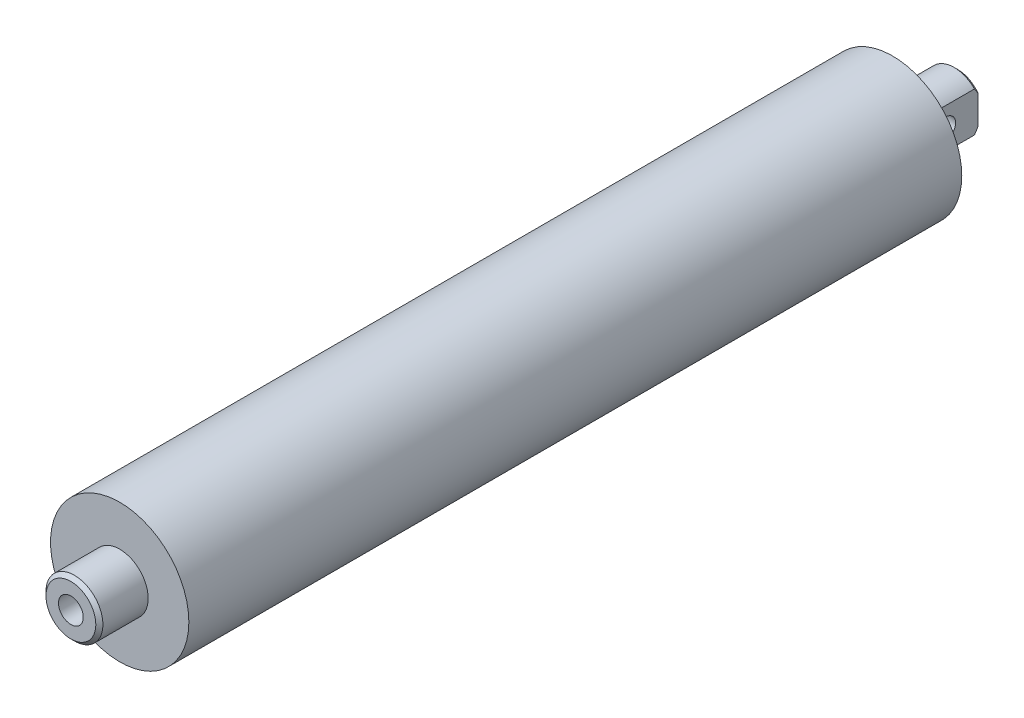
ISO-10303-21;
HEADER;
FILE_DESCRIPTION(('STEP AP214'),'2;1');
FILE_NAME('part.step','',(''),(''),'','','');
FILE_SCHEMA(('AUTOMOTIVE_DESIGN { 1 0 10303 214 1 1 1 1 }'));
ENDSEC;
DATA;
#1=APPLICATION_CONTEXT('core data for automotive mechanical design processes');
#2=APPLICATION_PROTOCOL_DEFINITION('international standard','automotive_design',2000,#1);
#3=PRODUCT_CONTEXT('',#1,'mechanical');
#4=PRODUCT('Part','Part','',(#3));
#5=PRODUCT_RELATED_PRODUCT_CATEGORY('part','',(#4));
#6=PRODUCT_DEFINITION_FORMATION('','',#4);
#7=PRODUCT_DEFINITION_CONTEXT('part definition',#1,'design');
#8=PRODUCT_DEFINITION('design','',#6,#7);
#9=PRODUCT_DEFINITION_SHAPE('','',#8);
#10=(LENGTH_UNIT() NAMED_UNIT(*) SI_UNIT(.MILLI.,.METRE.));
#11=(NAMED_UNIT(*) PLANE_ANGLE_UNIT() SI_UNIT($,.RADIAN.));
#12=(NAMED_UNIT(*) SI_UNIT($,.STERADIAN.) SOLID_ANGLE_UNIT());
#13=UNCERTAINTY_MEASURE_WITH_UNIT(LENGTH_MEASURE(1.E-05),#10,'distance_accuracy_value','');
#14=(GEOMETRIC_REPRESENTATION_CONTEXT(3) GLOBAL_UNCERTAINTY_ASSIGNED_CONTEXT((#13)) GLOBAL_UNIT_ASSIGNED_CONTEXT((#10,
#11,#12)) REPRESENTATION_CONTEXT('',''));
#15=CARTESIAN_POINT('',(0.,0.,0.));
#16=DIRECTION('',(0.,0.,1.));
#17=DIRECTION('',(1.,0.,0.));
#18=AXIS2_PLACEMENT_3D('',#15,#16,#17);
#19=CARTESIAN_POINT('',(0.,4.8641,9.525));
#20=DIRECTION('',(0.,0.,-1.));
#21=DIRECTION('',(-1.,0.,0.));
#22=AXIS2_PLACEMENT_3D('',#19,#20,#21);
#23=PLANE('',#22);
#24=CARTESIAN_POINT('',(0.,0.,9.525));
#25=DIRECTION('',(0.,0.,-1.));
#26=DIRECTION('',(-1.,0.,0.));
#27=AXIS2_PLACEMENT_3D('',#24,#25,#26);
#28=CIRCLE('',#27,2.413);
#29=CARTESIAN_POINT('',(-2.413,0.,9.525));
#30=VERTEX_POINT('',#29);
#31=EDGE_CURVE('E130',#30,#30,#28,.T.);
#32=ORIENTED_EDGE('',*,*,#31,.T.);
#33=EDGE_LOOP('',(#32));
#34=FACE_BOUND('',#33,.T.);
#35=CARTESIAN_POINT('',(0.,0.,9.525));
#36=DIRECTION('',(0.,0.,1.));
#37=DIRECTION('',(1.,0.,0.));
#38=AXIS2_PLACEMENT_3D('',#35,#36,#37);
#39=CIRCLE('',#38,4.8641);
#40=CARTESIAN_POINT('',(4.8641,0.,9.525));
#41=VERTEX_POINT('',#40);
#42=EDGE_CURVE('E133',#41,#41,#39,.T.);
#43=ORIENTED_EDGE('',*,*,#42,.T.);
#44=EDGE_LOOP('',(#43));
#45=FACE_BOUND('',#44,.T.);
#46=ADVANCED_FACE('F34',(#34,#45),#23,.F.);
#47=CARTESIAN_POINT('',(0.,0.,10.525));
#48=DIRECTION('',(0.,0.,1.));
#49=DIRECTION('',(1.,0.,0.));
#50=AXIS2_PLACEMENT_3D('',#47,#48,#49);
#51=CYLINDRICAL_SURFACE('',#50,2.413);
#52=CARTESIAN_POINT('',(0.,0.,0.));
#53=DIRECTION('',(0.,0.,1.));
#54=DIRECTION('',(1.,0.,0.));
#55=AXIS2_PLACEMENT_3D('',#52,#53,#54);
#56=CIRCLE('',#55,2.413);
#57=CARTESIAN_POINT('',(2.413,0.,0.));
#58=VERTEX_POINT('',#57);
#59=EDGE_CURVE('E396',#58,#58,#56,.F.);
#60=ORIENTED_EDGE('',*,*,#59,.T.);
#61=EDGE_LOOP('',(#60));
#62=FACE_BOUND('',#61,.T.);
#63=ORIENTED_EDGE('',*,*,#31,.F.);
#64=EDGE_LOOP('',(#63));
#65=FACE_BOUND('',#64,.T.);
#66=ADVANCED_FACE('F178',(#62,#65),#51,.F.);
#67=CARTESIAN_POINT('',(0.,0.,9.525));
#68=DIRECTION('',(0.,0.,-1.));
#69=DIRECTION('',(-1.,0.,0.));
#70=AXIS2_PLACEMENT_3D('',#67,#68,#69);
#71=CONICAL_SURFACE('',#70,4.8641,0.785398163397449);
#72=CARTESIAN_POINT('',(0.,0.,8.83285));
#73=DIRECTION('',(0.,0.,1.));
#74=DIRECTION('',(1.,0.,0.));
#75=AXIS2_PLACEMENT_3D('',#72,#73,#74);
#76=CIRCLE('',#75,5.55625);
#77=CARTESIAN_POINT('',(5.55625,0.,8.83285));
#78=VERTEX_POINT('',#77);
#79=EDGE_CURVE('E123',#78,#78,#76,.T.);
#80=ORIENTED_EDGE('',*,*,#79,.T.);
#81=EDGE_LOOP('',(#80));
#82=FACE_BOUND('',#81,.T.);
#83=ORIENTED_EDGE('',*,*,#42,.F.);
#84=EDGE_LOOP('',(#83));
#85=FACE_BOUND('',#84,.T.);
#86=ADVANCED_FACE('F163',(#82,#85),#71,.T.);
#87=CARTESIAN_POINT('',(0.,0.,-163.4998));
#88=DIRECTION('',(0.,0.,1.));
#89=DIRECTION('',(1.,0.,0.));
#90=AXIS2_PLACEMENT_3D('',#87,#88,#89);
#91=CYLINDRICAL_SURFACE('',#90,5.55625);
#92=CARTESIAN_POINT('',(0.,0.,0.));
#93=DIRECTION('',(0.,0.,1.));
#94=DIRECTION('',(1.,0.,0.));
#95=AXIS2_PLACEMENT_3D('',#92,#93,#94);
#96=CIRCLE('',#95,5.55625);
#97=CARTESIAN_POINT('',(5.55625,0.,0.));
#98=VERTEX_POINT('',#97);
#99=EDGE_CURVE('E114',#98,#98,#96,.T.);
#100=ORIENTED_EDGE('',*,*,#99,.T.);
#101=EDGE_LOOP('',(#100));
#102=FACE_BOUND('',#101,.T.);
#103=ORIENTED_EDGE('',*,*,#79,.F.);
#104=EDGE_LOOP('',(#103));
#105=FACE_BOUND('',#104,.T.);
#106=ADVANCED_FACE('F166',(#102,#105),#91,.T.);
#107=CARTESIAN_POINT('',(0.,5.55625,0.));
#108=DIRECTION('',(0.,0.,1.));
#109=DIRECTION('',(1.,0.,0.));
#110=AXIS2_PLACEMENT_3D('',#107,#108,#109);
#111=PLANE('',#110);
#112=ORIENTED_EDGE('',*,*,#99,.F.);
#113=EDGE_LOOP('',(#112));
#114=FACE_BOUND('',#113,.T.);
#115=CARTESIAN_POINT('',(0.,0.,0.));
#116=DIRECTION('',(0.,0.,1.));
#117=DIRECTION('',(1.,0.,0.));
#118=AXIS2_PLACEMENT_3D('',#115,#116,#117);
#119=CIRCLE('',#118,13.49375);
#120=CARTESIAN_POINT('',(13.49375,0.,0.));
#121=VERTEX_POINT('',#120);
#122=EDGE_CURVE('E405',#121,#121,#119,.T.);
#123=ORIENTED_EDGE('',*,*,#122,.T.);
#124=EDGE_LOOP('',(#123));
#125=FACE_BOUND('',#124,.T.);
#126=ADVANCED_FACE('F168',(#114,#125),#111,.T.);
#127=CARTESIAN_POINT('',(0.,0.,-188.965888514544));
#128=DIRECTION('',(0.,0.,1.));
#129=DIRECTION('',(1.,0.,0.));
#130=AXIS2_PLACEMENT_3D('',#127,#128,#129);
#131=CYLINDRICAL_SURFACE('',#130,13.49375);
#132=CARTESIAN_POINT('',(0.,0.,-150.7998));
#133=DIRECTION('',(0.,0.,1.));
#134=DIRECTION('',(1.,0.,0.));
#135=AXIS2_PLACEMENT_3D('',#132,#133,#134);
#136=CIRCLE('',#135,13.49375);
#137=CARTESIAN_POINT('',(13.49375,0.,-150.7998));
#138=VERTEX_POINT('',#137);
#139=EDGE_CURVE('E401',#138,#138,#136,.F.);
#140=ORIENTED_EDGE('',*,*,#139,.F.);
#141=EDGE_LOOP('',(#140));
#142=FACE_BOUND('',#141,.T.);
#143=ORIENTED_EDGE('',*,*,#122,.F.);
#144=EDGE_LOOP('',(#143));
#145=FACE_BOUND('',#144,.T.);
#146=ADVANCED_FACE('F175',(#142,#145),#131,.T.);
#147=CARTESIAN_POINT('',(0.,0.,-162.80765));
#148=DIRECTION('',(0.,0.,1.));
#149=DIRECTION('',(1.,0.,0.));
#150=AXIS2_PLACEMENT_3D('',#147,#148,#149);
#151=CONICAL_SURFACE('',#150,5.55625,0.785398163397448);
#152=CARTESIAN_POINT('',(-3.9624,-0.969101977446747,-164.284712286411));
#153=CARTESIAN_POINT('',(-3.9624,-1.13068640604388,-164.246311172316));
#154=CARTESIAN_POINT('',(-3.9624,-1.28994775793632,-164.199419417403));
#155=CARTESIAN_POINT('',(-3.9624,-1.60333341969988,-164.091939917732));
#156=CARTESIAN_POINT('',(-3.9624,-1.75747072963709,-164.03139044592));
#157=CARTESIAN_POINT('',(-3.9624,-2.05964814876518,-163.900225702267));
#158=CARTESIAN_POINT('',(-3.9624,-2.20773061533367,-163.829705818722));
#159=CARTESIAN_POINT('',(-3.9624,-2.49983013394974,-163.680524911675));
#160=CARTESIAN_POINT('',(-3.9624,-2.64384426673838,-163.60185822222));
#161=CARTESIAN_POINT('',(-3.9624,-2.97865162599333,-163.409297249467));
#162=CARTESIAN_POINT('',(-3.9624,-3.16793916729479,-163.292797349721));
#163=CARTESIAN_POINT('',(-3.9624,-3.44822796646857,-163.111679286049));
#164=CARTESIAN_POINT('',(-3.9624,-3.54123733208894,-163.050112473599));
#165=CARTESIAN_POINT('',(-3.9624,-3.72606003214522,-162.925196372629));
#166=CARTESIAN_POINT('',(-3.9624,-3.81787331221411,-162.861847003496));
#167=CARTESIAN_POINT('',(-3.9624,-4.13510930012632,-162.639062150384));
#168=CARTESIAN_POINT('',(-3.9624,-4.35781168912625,-162.475752538043));
#169=CARTESIAN_POINT('',(-3.9624,-4.79833256826101,-162.14265306304));
#170=CARTESIAN_POINT('',(-3.9624,-5.01615013054771,-161.972861985532));
#171=CARTESIAN_POINT('',(-3.9624,-5.44820711062955,-161.628429433672));
#172=CARTESIAN_POINT('',(-3.9624,-5.66244333830345,-161.45378396918));
#173=CARTESIAN_POINT('',(-3.9624,-6.08799577992029,-161.100968563587));
#174=CARTESIAN_POINT('',(-3.9624,-6.29931189586815,-160.922798504691));
#175=CARTESIAN_POINT('',(-3.9624,-6.71458448023476,-160.568074427852));
#176=CARTESIAN_POINT('',(-3.9624,-6.91859577520607,-160.391584467097));
#177=CARTESIAN_POINT('',(-3.9624,-7.32485238398993,-160.036575337413));
#178=CARTESIAN_POINT('',(-3.9624,-7.52709764941854,-159.858056113195));
#179=CARTESIAN_POINT('',(-3.9624,-7.92970311281624,-159.499794408043));
#180=CARTESIAN_POINT('',(-3.9624,-8.13006647943731,-159.320055483056));
#181=CARTESIAN_POINT('',(-3.9624,-8.52958520330408,-158.95926357113));
#182=CARTESIAN_POINT('',(-3.9624,-8.72874063269433,-158.778210664117));
#183=CARTESIAN_POINT('',(-3.9624,-8.9274178047907,-158.596638233195));
#184=B_SPLINE_CURVE_WITH_KNOTS('',3,(#152,#153,#154,#155,#156,#157,#158,#159,#160,#161,#162,
#163,#164,#165,#166,#167,#168,#169,#170,#171,#172,#173,#174,#175,#176,#177,#178,#179,#180,#181,
#182,#183),.UNSPECIFIED.,.F.,.F.,(4,2,2,2,2,2,2,2,2,2,2,2,2,2,2,4),(0.,0.497595602619497,
0.993813747624916,1.48557075189767,1.97767209061825,2.64413954728892,2.97874761710828,
3.31337084354308,4.14166804733263,4.9701212717822,5.79927686112941,6.62846020859948,
7.43771732860165,8.24699655070783,9.05449505709329,9.86194485076686),.UNSPECIFIED.);
#185=CARTESIAN_POINT('',(-3.9624,-2.82114428025225,-163.4998));
#186=VERTEX_POINT('',#185);
#187=CARTESIAN_POINT('',(-3.9624,-3.89503534034032,-162.80765));
#188=VERTEX_POINT('',#187);
#189=EDGE_CURVE('E52',#186,#188,#184,.T.);
#190=ORIENTED_EDGE('',*,*,#189,.F.);
#191=CARTESIAN_POINT('',(0.,0.,-163.4998));
#192=DIRECTION('',(0.,0.,1.));
#193=DIRECTION('',(1.,0.,0.));
#194=AXIS2_PLACEMENT_3D('',#191,#192,#193);
#195=CIRCLE('',#194,4.8641);
#196=CARTESIAN_POINT('',(3.9624,-2.82114428025225,-163.4998));
#197=VERTEX_POINT('',#196);
#198=EDGE_CURVE('E44',#186,#197,#195,.T.);
#199=ORIENTED_EDGE('',*,*,#198,.T.);
#200=CARTESIAN_POINT('',(3.9624,-8.9274178047907,-158.596638233195));
#201=CARTESIAN_POINT('',(3.9624,-8.72428348123455,-158.782282376779));
#202=CARTESIAN_POINT('',(3.9624,-8.52065022374037,-158.967384789872));
#203=CARTESIAN_POINT('',(3.9624,-8.11211578377209,-159.336209390757));
#204=CARTESIAN_POINT('',(3.9624,-7.90721452519279,-159.51993149421));
#205=CARTESIAN_POINT('',(3.9624,-7.49571833544613,-159.885836414154));
#206=CARTESIAN_POINT('',(3.9624,-7.28912207722841,-160.068017740368));
#207=CARTESIAN_POINT('',(3.9624,-6.87406215201803,-160.430233820144));
#208=CARTESIAN_POINT('',(3.9624,-6.66559853048815,-160.610268625718));
#209=CARTESIAN_POINT('',(3.9624,-6.25020375797475,-160.964300698062));
#210=CARTESIAN_POINT('',(3.9624,-6.04331538624991,-161.138348064062));
#211=CARTESIAN_POINT('',(3.9624,-5.62669988195489,-161.483009741046));
#212=CARTESIAN_POINT('',(3.9624,-5.41697283710367,-161.65362415771));
#213=CARTESIAN_POINT('',(3.9624,-4.99378223089531,-161.990358505101));
#214=CARTESIAN_POINT('',(3.9624,-4.78031708986057,-162.156476456306));
#215=CARTESIAN_POINT('',(3.9624,-4.34866002550125,-162.482457666028));
#216=CARTESIAN_POINT('',(3.9624,-4.13046868777682,-162.642321692627));
#217=CARTESIAN_POINT('',(3.9624,-3.79675836824015,-162.876675066598));
#218=CARTESIAN_POINT('',(3.9624,-3.68355562905748,-162.95446194405));
#219=CARTESIAN_POINT('',(3.9624,-3.45528673073584,-163.107245740598));
#220=CARTESIAN_POINT('',(3.9624,-3.34022069373754,-163.182242841512));
#221=CARTESIAN_POINT('',(3.9624,-3.10817684926037,-163.328694338983));
#222=CARTESIAN_POINT('',(3.9624,-2.99120343784379,-163.400155673904));
#223=CARTESIAN_POINT('',(3.9624,-2.75482172310337,-163.538913040068));
#224=CARTESIAN_POINT('',(3.9624,-2.63541376052635,-163.60620964897));
#225=CARTESIAN_POINT('',(3.9624,-2.39258659691828,-163.736323091482));
#226=CARTESIAN_POINT('',(3.9624,-2.26913885666752,-163.799087051817));
#227=CARTESIAN_POINT('',(3.9624,-2.01917957337547,-163.918045381871));
#228=CARTESIAN_POINT('',(3.9624,-1.8926697510374,-163.974243342361));
#229=CARTESIAN_POINT('',(3.9624,-1.6353813629376,-164.078903972605));
#230=CARTESIAN_POINT('',(3.9624,-1.50457880738669,-164.127308684686));
#231=CARTESIAN_POINT('',(3.9624,-1.23942090185577,-164.214074358762));
#232=CARTESIAN_POINT('',(3.9624,-1.10505903529012,-164.252415261731));
#233=CARTESIAN_POINT('',(3.9624,-0.969101977446747,-164.284712286411));
#234=B_SPLINE_CURVE_WITH_KNOTS('',3,(#200,#201,#202,#203,#204,#205,#206,#207,#208,#209,#210,
#211,#212,#213,#214,#215,#216,#217,#218,#219,#220,#221,#222,#223,#224,#225,#226,#227,#228,#229,
#230,#231,#232,#233),.UNSPECIFIED.,.F.,.F.,(4,2,2,2,2,2,2,2,2,2,2,2,2,2,2,2,4),(0.,
0.825561090574466,1.65117222128619,2.47750697676129,3.30382166869636,4.11487854589622,
4.92591041726744,5.73729371354572,6.54857704391498,6.96060201462924,7.37260008523554,
7.78375470633796,8.1948521708178,8.61015533011751,9.02523029739879,9.44326222653234,
9.86212114968798),.UNSPECIFIED.);
#235=CARTESIAN_POINT('',(3.9624,-3.89503534034032,-162.80765));
#236=VERTEX_POINT('',#235);
#237=EDGE_CURVE('E142',#236,#197,#234,.T.);
#238=ORIENTED_EDGE('',*,*,#237,.F.);
#239=CARTESIAN_POINT('',(0.,0.,-162.80765));
#240=DIRECTION('',(0.,0.,1.));
#241=DIRECTION('',(1.,0.,0.));
#242=AXIS2_PLACEMENT_3D('',#239,#240,#241);
#243=CIRCLE('',#242,5.55625);
#244=EDGE_CURVE('E120',#188,#236,#243,.T.);
#245=ORIENTED_EDGE('',*,*,#244,.F.);
#246=EDGE_LOOP('',(#190,#199,#238,#245));
#247=FACE_BOUND('',#246,.T.);
#248=ADVANCED_FACE('F210',(#247),#151,.T.);
#249=CARTESIAN_POINT('',(0.,0.,-163.4998));
#250=DIRECTION('',(0.,0.,1.));
#251=DIRECTION('',(1.,0.,0.));
#252=AXIS2_PLACEMENT_3D('',#249,#250,#251);
#253=CYLINDRICAL_SURFACE('',#252,5.55625);
#254=DIRECTION('',(0.,0.,1.));
#255=VECTOR('',#254,1.);
#256=CARTESIAN_POINT('',(-3.9624,3.89503534034032,-163.4998));
#257=LINE('',#256,#255);
#258=CARTESIAN_POINT('',(-3.9624,3.89503534034032,-150.7998));
#259=VERTEX_POINT('',#258);
#260=CARTESIAN_POINT('',(-3.9624,3.89503534034032,-162.80765));
#261=VERTEX_POINT('',#260);
#262=EDGE_CURVE('E232',#259,#261,#257,.F.);
#263=ORIENTED_EDGE('',*,*,#262,.F.);
#264=CARTESIAN_POINT('',(0.,0.,-150.7998));
#265=DIRECTION('',(0.,0.,1.));
#266=DIRECTION('',(1.,0.,0.));
#267=AXIS2_PLACEMENT_3D('',#264,#265,#266);
#268=CIRCLE('',#267,5.55625);
#269=CARTESIAN_POINT('',(3.9624,3.89503534034032,-150.7998));
#270=VERTEX_POINT('',#269);
#271=EDGE_CURVE('E105',#270,#259,#268,.T.);
#272=ORIENTED_EDGE('',*,*,#271,.F.);
#273=DIRECTION('',(0.,0.,1.));
#274=VECTOR('',#273,1.);
#275=CARTESIAN_POINT('',(3.9624,3.89503534034032,-163.4998));
#276=LINE('',#275,#274);
#277=CARTESIAN_POINT('',(3.9624,3.89503534034032,-162.80765));
#278=VERTEX_POINT('',#277);
#279=EDGE_CURVE('E203',#278,#270,#276,.T.);
#280=ORIENTED_EDGE('',*,*,#279,.F.);
#281=EDGE_CURVE('E127',#278,#261,#243,.T.);
#282=ORIENTED_EDGE('',*,*,#281,.T.);
#283=EDGE_LOOP('',(#263,#272,#280,#282));
#284=FACE_BOUND('',#283,.T.);
#285=ADVANCED_FACE('F242',(#284),#253,.T.);
#286=CARTESIAN_POINT('',(0.,4.8641,-163.4998));
#287=DIRECTION('',(0.,0.,-1.));
#288=DIRECTION('',(-1.,0.,0.));
#289=AXIS2_PLACEMENT_3D('',#286,#287,#288);
#290=PLANE('',#289);
#291=DIRECTION('',(0.,-1.,0.));
#292=VECTOR('',#291,1.);
#293=CARTESIAN_POINT('',(-3.9624,4.8641,-163.4998));
#294=LINE('',#293,#292);
#295=CARTESIAN_POINT('',(-3.9624,2.82114428025225,-163.4998));
#296=VERTEX_POINT('',#295);
#297=EDGE_CURVE('E223',#296,#186,#294,.T.);
#298=ORIENTED_EDGE('',*,*,#297,.F.);
#299=CARTESIAN_POINT('',(3.9624,2.82114428025225,-163.4998));
#300=VERTEX_POINT('',#299);
#301=EDGE_CURVE('E11',#300,#296,#195,.T.);
#302=ORIENTED_EDGE('',*,*,#301,.F.);
#303=DIRECTION('',(0.,1.,0.));
#304=VECTOR('',#303,1.);
#305=CARTESIAN_POINT('',(3.9624,4.8641,-163.4998));
#306=LINE('',#305,#304);
#307=EDGE_CURVE('E148',#197,#300,#306,.T.);
#308=ORIENTED_EDGE('',*,*,#307,.F.);
#309=ORIENTED_EDGE('',*,*,#198,.F.);
#310=EDGE_LOOP('',(#298,#302,#308,#309));
#311=FACE_BOUND('',#310,.T.);
#312=ADVANCED_FACE('F36',(#311),#290,.T.);
#313=CARTESIAN_POINT('',(-3.9624,8.92741780479069,-158.596638233195));
#314=CARTESIAN_POINT('',(-3.9624,8.72428348123454,-158.782282376779));
#315=CARTESIAN_POINT('',(-3.9624,8.52065022374036,-158.967384789872));
#316=CARTESIAN_POINT('',(-3.9624,8.11211578377208,-159.336209390757));
#317=CARTESIAN_POINT('',(-3.9624,7.90721452519278,-159.51993149421));
#318=CARTESIAN_POINT('',(-3.9624,7.49571833544612,-159.885836414154));
#319=CARTESIAN_POINT('',(-3.9624,7.2891220772284,-160.068017740368));
#320=CARTESIAN_POINT('',(-3.9624,6.87406215201802,-160.430233820144));
#321=CARTESIAN_POINT('',(-3.9624,6.66559853048815,-160.610268625718));
#322=CARTESIAN_POINT('',(-3.9624,6.25020375797474,-160.964300698062));
#323=CARTESIAN_POINT('',(-3.9624,6.0433153862499,-161.138348064061));
#324=CARTESIAN_POINT('',(-3.9624,5.62669988195488,-161.483009741046));
#325=CARTESIAN_POINT('',(-3.9624,5.41697283710367,-161.65362415771));
#326=CARTESIAN_POINT('',(-3.9624,4.99378223089532,-161.990358505101));
#327=CARTESIAN_POINT('',(-3.9624,4.78031708986057,-162.156476456306));
#328=CARTESIAN_POINT('',(-3.9624,4.34866002550125,-162.482457666028));
#329=CARTESIAN_POINT('',(-3.9624,4.13046868777682,-162.642321692627));
#330=CARTESIAN_POINT('',(-3.9624,3.79675836824014,-162.876675066598));
#331=CARTESIAN_POINT('',(-3.9624,3.68355562905747,-162.95446194405));
#332=CARTESIAN_POINT('',(-3.9624,3.45528673073582,-163.107245740598));
#333=CARTESIAN_POINT('',(-3.9624,3.34022069373751,-163.182242841512));
#334=CARTESIAN_POINT('',(-3.9624,3.10817684926034,-163.328694338983));
#335=CARTESIAN_POINT('',(-3.9624,2.99120343784377,-163.400155673904));
#336=CARTESIAN_POINT('',(-3.9624,2.75482172310337,-163.538913040068));
#337=CARTESIAN_POINT('',(-3.9624,2.63541376052634,-163.60620964897));
#338=CARTESIAN_POINT('',(-3.9624,2.39258659691827,-163.736323091482));
#339=CARTESIAN_POINT('',(-3.9624,2.26913885666751,-163.799087051817));
#340=CARTESIAN_POINT('',(-3.9624,2.01917957337546,-163.918045381871));
#341=CARTESIAN_POINT('',(-3.9624,1.89266975103739,-163.974243342361));
#342=CARTESIAN_POINT('',(-3.9624,1.6353813629376,-164.078903972605));
#343=CARTESIAN_POINT('',(-3.9624,1.50457880738669,-164.127308684686));
#344=CARTESIAN_POINT('',(-3.9624,1.23942090185577,-164.214074358762));
#345=CARTESIAN_POINT('',(-3.9624,1.10505903529012,-164.252415261731));
#346=CARTESIAN_POINT('',(-3.9624,0.969101977446746,-164.284712286411));
#347=B_SPLINE_CURVE_WITH_KNOTS('',3,(#313,#314,#315,#316,#317,#318,#319,#320,#321,#322,#323,
#324,#325,#326,#327,#328,#329,#330,#331,#332,#333,#334,#335,#336,#337,#338,#339,#340,#341,#342,
#343,#344,#345,#346),.UNSPECIFIED.,.F.,.F.,(4,2,2,2,2,2,2,2,2,2,2,2,2,2,2,2,4),(0.,
0.825561090574466,1.65117222128619,2.47750697676129,3.30382166869636,4.1148785458962,
4.92591041726743,5.73729371354571,6.54857704391497,6.96060201462925,7.37260008523553,
7.78375470633796,8.19485217081779,8.61015533011751,9.02523029739877,9.44326222653232,
9.86212114968797),.UNSPECIFIED.);
#348=EDGE_CURVE('E225',#261,#296,#347,.T.);
#349=ORIENTED_EDGE('',*,*,#348,.F.);
#350=ORIENTED_EDGE('',*,*,#281,.F.);
#351=CARTESIAN_POINT('',(3.9624,0.969101977446747,-164.284712286411));
#352=CARTESIAN_POINT('',(3.9624,1.13068640604388,-164.246311172316));
#353=CARTESIAN_POINT('',(3.9624,1.28994775793633,-164.199419417403));
#354=CARTESIAN_POINT('',(3.9624,1.60333341969988,-164.091939917732));
#355=CARTESIAN_POINT('',(3.9624,1.75747072963709,-164.03139044592));
#356=CARTESIAN_POINT('',(3.9624,2.05964814876519,-163.900225702267));
#357=CARTESIAN_POINT('',(3.9624,2.20773061533368,-163.829705818722));
#358=CARTESIAN_POINT('',(3.9624,2.49983013394974,-163.680524911675));
#359=CARTESIAN_POINT('',(3.9624,2.64384426673838,-163.60185822222));
#360=CARTESIAN_POINT('',(3.9624,2.97865162599333,-163.409297249467));
#361=CARTESIAN_POINT('',(3.9624,3.16793916729481,-163.292797349721));
#362=CARTESIAN_POINT('',(3.9624,3.44822796646858,-163.111679286049));
#363=CARTESIAN_POINT('',(3.9624,3.54123733208894,-163.050112473599));
#364=CARTESIAN_POINT('',(3.9624,3.72606003214521,-162.925196372629));
#365=CARTESIAN_POINT('',(3.9624,3.81787331221411,-162.861847003496));
#366=CARTESIAN_POINT('',(3.9624,4.13510930012633,-162.639062150384));
#367=CARTESIAN_POINT('',(3.9624,4.35781168912626,-162.475752538043));
#368=CARTESIAN_POINT('',(3.9624,4.79833256826103,-162.14265306304));
#369=CARTESIAN_POINT('',(3.9624,5.01615013054773,-161.972861985532));
#370=CARTESIAN_POINT('',(3.9624,5.44820711062957,-161.628429433672));
#371=CARTESIAN_POINT('',(3.9624,5.66244333830346,-161.45378396918));
#372=CARTESIAN_POINT('',(3.9624,6.0879957799203,-161.100968563587));
#373=CARTESIAN_POINT('',(3.9624,6.29931189586815,-160.922798504691));
#374=CARTESIAN_POINT('',(3.9624,6.71458448023476,-160.568074427852));
#375=CARTESIAN_POINT('',(3.9624,6.91859577520608,-160.391584467097));
#376=CARTESIAN_POINT('',(3.9624,7.32485238398994,-160.036575337413));
#377=CARTESIAN_POINT('',(3.9624,7.52709764941855,-159.858056113195));
#378=CARTESIAN_POINT('',(3.9624,7.92970311281625,-159.499794408043));
#379=CARTESIAN_POINT('',(3.9624,8.13006647943732,-159.320055483056));
#380=CARTESIAN_POINT('',(3.9624,8.52958520330408,-158.95926357113));
#381=CARTESIAN_POINT('',(3.9624,8.72874063269433,-158.778210664117));
#382=CARTESIAN_POINT('',(3.9624,8.9274178047907,-158.596638233195));
#383=B_SPLINE_CURVE_WITH_KNOTS('',3,(#351,#352,#353,#354,#355,#356,#357,#358,#359,#360,#361,
#362,#363,#364,#365,#366,#367,#368,#369,#370,#371,#372,#373,#374,#375,#376,#377,#378,#379,#380,
#381,#382),.UNSPECIFIED.,.F.,.F.,(4,2,2,2,2,2,2,2,2,2,2,2,2,2,2,4),(0.,0.497595602619499,
0.99381374762491,1.48557075189767,1.97767209061826,2.64413954728892,2.97874761710829,
3.31337084354309,4.14166804733265,4.97012127178222,5.79927686112942,6.62846020859949,
7.43771732860167,8.24699655070784,9.05449505709331,9.86194485076687),.UNSPECIFIED.);
#384=EDGE_CURVE('E60',#300,#278,#383,.T.);
#385=ORIENTED_EDGE('',*,*,#384,.F.);
#386=ORIENTED_EDGE('',*,*,#301,.T.);
#387=EDGE_LOOP('',(#349,#350,#385,#386));
#388=FACE_BOUND('',#387,.T.);
#389=ADVANCED_FACE('F205',(#388),#151,.T.);
#390=DIRECTION('',(0.,0.,1.));
#391=VECTOR('',#390,1.);
#392=CARTESIAN_POINT('',(-3.9624,-3.89503534034032,-163.4998));
#393=LINE('',#392,#391);
#394=CARTESIAN_POINT('',(-3.9624,-3.89503534034032,-150.7998));
#395=VERTEX_POINT('',#394);
#396=EDGE_CURVE('E87',#188,#395,#393,.T.);
#397=ORIENTED_EDGE('',*,*,#396,.F.);
#398=ORIENTED_EDGE('',*,*,#244,.T.);
#399=DIRECTION('',(0.,0.,1.));
#400=VECTOR('',#399,1.);
#401=CARTESIAN_POINT('',(3.9624,-3.89503534034032,-163.4998));
#402=LINE('',#401,#400);
#403=CARTESIAN_POINT('',(3.9624,-3.89503534034032,-150.7998));
#404=VERTEX_POINT('',#403);
#405=EDGE_CURVE('E112',#404,#236,#402,.F.);
#406=ORIENTED_EDGE('',*,*,#405,.F.);
#407=EDGE_CURVE('E102',#395,#404,#268,.T.);
#408=ORIENTED_EDGE('',*,*,#407,.F.);
#409=EDGE_LOOP('',(#397,#398,#406,#408));
#410=FACE_BOUND('',#409,.T.);
#411=ADVANCED_FACE('F110',(#410),#253,.T.);
#412=CARTESIAN_POINT('',(0.,5.55625,-150.7998));
#413=DIRECTION('',(0.,0.,1.));
#414=DIRECTION('',(1.,0.,0.));
#415=AXIS2_PLACEMENT_3D('',#412,#413,#414);
#416=PLANE('',#415);
#417=ORIENTED_EDGE('',*,*,#271,.T.);
#418=DIRECTION('',(0.,1.,0.));
#419=VECTOR('',#418,1.);
#420=CARTESIAN_POINT('',(-3.9624,0.,-150.7998));
#421=LINE('',#420,#419);
#422=EDGE_CURVE('E90',#395,#259,#421,.T.);
#423=ORIENTED_EDGE('',*,*,#422,.F.);
#424=ORIENTED_EDGE('',*,*,#407,.T.);
#425=DIRECTION('',(0.,-1.,0.));
#426=VECTOR('',#425,1.);
#427=CARTESIAN_POINT('',(3.9624,0.,-150.7998));
#428=LINE('',#427,#426);
#429=EDGE_CURVE('E234',#270,#404,#428,.T.);
#430=ORIENTED_EDGE('',*,*,#429,.F.);
#431=EDGE_LOOP('',(#417,#423,#424,#430));
#432=FACE_BOUND('',#431,.T.);
#433=ORIENTED_EDGE('',*,*,#139,.T.);
#434=EDGE_LOOP('',(#433));
#435=FACE_BOUND('',#434,.T.);
#436=ADVANCED_FACE('F99',(#432,#435),#416,.F.);
#437=CARTESIAN_POINT('',(3.9624,0.,-163.4998));
#438=DIRECTION('',(-1.,0.,0.));
#439=DIRECTION('',(0.,0.,1.));
#440=AXIS2_PLACEMENT_3D('',#437,#438,#439);
#441=PLANE('',#440);
#442=CARTESIAN_POINT('',(3.9624,0.,-157.1498));
#443=DIRECTION('',(-1.,0.,0.));
#444=DIRECTION('',(0.,0.,1.));
#445=AXIS2_PLACEMENT_3D('',#442,#443,#444);
#446=CIRCLE('',#445,1.9812);
#447=CARTESIAN_POINT('',(3.9624,0.,-155.1686));
#448=VERTEX_POINT('',#447);
#449=EDGE_CURVE('E107',#448,#448,#446,.T.);
#450=ORIENTED_EDGE('',*,*,#449,.T.);
#451=EDGE_LOOP('',(#450));
#452=FACE_BOUND('',#451,.T.);
#453=ORIENTED_EDGE('',*,*,#405,.T.);
#454=ORIENTED_EDGE('',*,*,#237,.T.);
#455=ORIENTED_EDGE('',*,*,#307,.T.);
#456=ORIENTED_EDGE('',*,*,#384,.T.);
#457=ORIENTED_EDGE('',*,*,#279,.T.);
#458=ORIENTED_EDGE('',*,*,#429,.T.);
#459=EDGE_LOOP('',(#453,#454,#455,#456,#457,#458));
#460=FACE_BOUND('',#459,.T.);
#461=ADVANCED_FACE('F188',(#452,#460),#441,.F.);
#462=CARTESIAN_POINT('',(-3.9624,0.,-163.4998));
#463=DIRECTION('',(1.,0.,0.));
#464=DIRECTION('',(0.,0.,1.));
#465=AXIS2_PLACEMENT_3D('',#462,#463,#464);
#466=PLANE('',#465);
#467=CARTESIAN_POINT('',(-3.9624,0.,-157.1498));
#468=DIRECTION('',(1.,0.,0.));
#469=DIRECTION('',(0.,-1.,0.));
#470=AXIS2_PLACEMENT_3D('',#467,#468,#469);
#471=CIRCLE('',#470,1.9812);
#472=CARTESIAN_POINT('',(-3.9624,-1.9812,-157.1498));
#473=VERTEX_POINT('',#472);
#474=EDGE_CURVE('E38',#473,#473,#471,.T.);
#475=ORIENTED_EDGE('',*,*,#474,.T.);
#476=EDGE_LOOP('',(#475));
#477=FACE_BOUND('',#476,.T.);
#478=ORIENTED_EDGE('',*,*,#262,.T.);
#479=ORIENTED_EDGE('',*,*,#348,.T.);
#480=ORIENTED_EDGE('',*,*,#297,.T.);
#481=ORIENTED_EDGE('',*,*,#189,.T.);
#482=ORIENTED_EDGE('',*,*,#396,.T.);
#483=ORIENTED_EDGE('',*,*,#422,.T.);
#484=EDGE_LOOP('',(#478,#479,#480,#481,#482,#483));
#485=FACE_BOUND('',#484,.T.);
#486=ADVANCED_FACE('F89',(#477,#485),#466,.F.);
#487=CARTESIAN_POINT('',(-17.4498,0.,-157.1498));
#488=DIRECTION('',(1.,0.,0.));
#489=DIRECTION('',(0.,1.,0.));
#490=AXIS2_PLACEMENT_3D('',#487,#488,#489);
#491=CYLINDRICAL_SURFACE('',#490,1.9812);
#492=ORIENTED_EDGE('',*,*,#474,.F.);
#493=EDGE_LOOP('',(#492));
#494=FACE_BOUND('',#493,.T.);
#495=ORIENTED_EDGE('',*,*,#449,.F.);
#496=EDGE_LOOP('',(#495));
#497=FACE_BOUND('',#496,.T.);
#498=ADVANCED_FACE('F304',(#494,#497),#491,.F.);
#499=CARTESIAN_POINT('',(0.,0.,0.));
#500=DIRECTION('',(0.,0.,1.));
#501=DIRECTION('',(1.,0.,0.));
#502=AXIS2_PLACEMENT_3D('',#499,#500,#501);
#503=PLANE('',#502);
#504=ORIENTED_EDGE('',*,*,#59,.F.);
#505=EDGE_LOOP('',(#504));
#506=FACE_BOUND('',#505,.T.);
#507=ADVANCED_FACE('F309',(#506),#503,.T.);
#508=CLOSED_SHELL('',(#46,#66,#86,#106,#126,#146,#248,#285,#312,#389,#411,#436,#461,#486,#498,#507));
#509=MANIFOLD_SOLID_BREP('B2',#508);
#510=ADVANCED_BREP_SHAPE_REPRESENTATION('',(#18,#509),#14);
#511=SHAPE_DEFINITION_REPRESENTATION(#9,#510);
ENDSEC;
END-ISO-10303-21;
